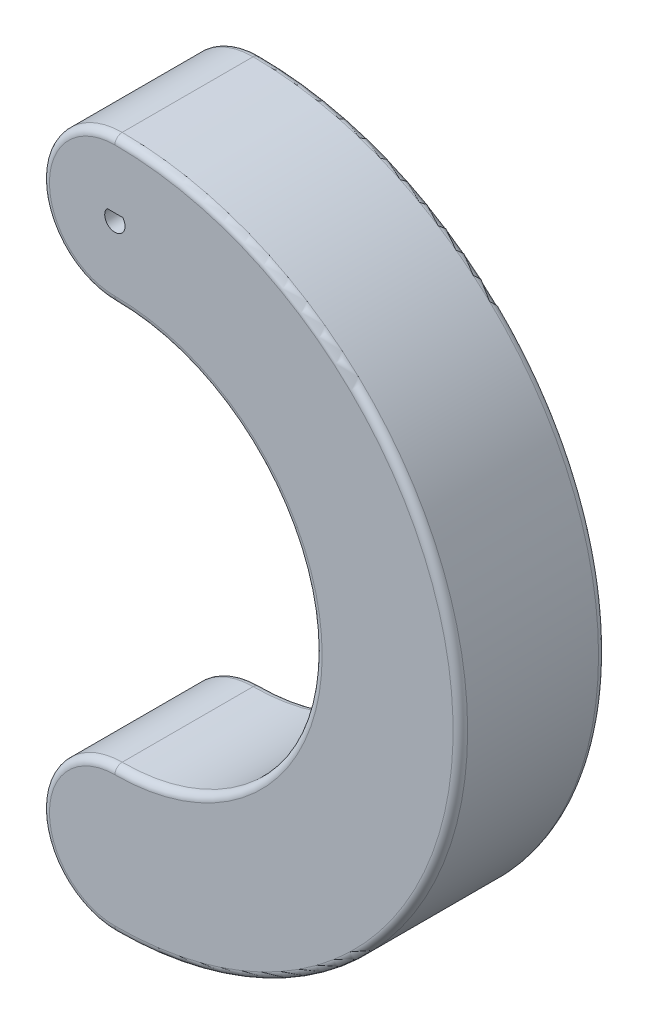
ISO-10303-21;
HEADER;
FILE_DESCRIPTION(('STEP AP214'),'2;1');
FILE_NAME('part.step','',(''),(''),'','','');
FILE_SCHEMA(('AUTOMOTIVE_DESIGN { 1 0 10303 214 1 1 1 1 }'));
ENDSEC;
DATA;
#1=APPLICATION_CONTEXT('core data for automotive mechanical design processes');
#2=APPLICATION_PROTOCOL_DEFINITION('international standard','automotive_design',2000,#1);
#3=PRODUCT_CONTEXT('',#1,'mechanical');
#4=PRODUCT('Part','Part','',(#3));
#5=PRODUCT_RELATED_PRODUCT_CATEGORY('part','',(#4));
#6=PRODUCT_DEFINITION_FORMATION('','',#4);
#7=PRODUCT_DEFINITION_CONTEXT('part definition',#1,'design');
#8=PRODUCT_DEFINITION('design','',#6,#7);
#9=PRODUCT_DEFINITION_SHAPE('','',#8);
#10=(LENGTH_UNIT() NAMED_UNIT(*) SI_UNIT(.MILLI.,.METRE.));
#11=(NAMED_UNIT(*) PLANE_ANGLE_UNIT() SI_UNIT($,.RADIAN.));
#12=(NAMED_UNIT(*) SI_UNIT($,.STERADIAN.) SOLID_ANGLE_UNIT());
#13=UNCERTAINTY_MEASURE_WITH_UNIT(LENGTH_MEASURE(1.E-05),#10,'distance_accuracy_value','');
#14=(GEOMETRIC_REPRESENTATION_CONTEXT(3) GLOBAL_UNCERTAINTY_ASSIGNED_CONTEXT((#13)) GLOBAL_UNIT_ASSIGNED_CONTEXT((#10,
#11,#12)) REPRESENTATION_CONTEXT('',''));
#15=CARTESIAN_POINT('',(0.,0.,0.));
#16=DIRECTION('',(0.,0.,1.));
#17=DIRECTION('',(1.,0.,0.));
#18=AXIS2_PLACEMENT_3D('',#15,#16,#17);
#19=CARTESIAN_POINT('',(0.,0.635,20.));
#20=DIRECTION('',(0.,0.,-1.));
#21=DIRECTION('',(-1.,0.,0.));
#22=AXIS2_PLACEMENT_3D('',#19,#20,#21);
#23=CYLINDRICAL_SURFACE('',#22,10.);
#24=DIRECTION('',(0.,0.,-1.));
#25=VECTOR('',#24,1.);
#26=CARTESIAN_POINT('',(0.,10.635,20.));
#27=LINE('',#26,#25);
#28=CARTESIAN_POINT('',(0.,10.635,19.));
#29=VERTEX_POINT('',#28);
#30=CARTESIAN_POINT('',(0.,10.635,1.));
#31=VERTEX_POINT('',#30);
#32=EDGE_CURVE('E147',#29,#31,#27,.T.);
#33=ORIENTED_EDGE('',*,*,#32,.T.);
#34=CARTESIAN_POINT('',(0.,0.635,1.));
#35=DIRECTION('',(0.,0.,1.));
#36=DIRECTION('',(1.,0.,0.));
#37=AXIS2_PLACEMENT_3D('',#34,#35,#36);
#38=CIRCLE('',#37,10.);
#39=CARTESIAN_POINT('',(0.,-9.365,1.));
#40=VERTEX_POINT('',#39);
#41=EDGE_CURVE('E187',#31,#40,#38,.T.);
#42=ORIENTED_EDGE('',*,*,#41,.T.);
#43=DIRECTION('',(0.,0.,-1.));
#44=VECTOR('',#43,1.);
#45=CARTESIAN_POINT('',(0.,-9.365,20.));
#46=LINE('',#45,#44);
#47=CARTESIAN_POINT('',(0.,-9.365,19.));
#48=VERTEX_POINT('',#47);
#49=EDGE_CURVE('E177',#48,#40,#46,.T.);
#50=ORIENTED_EDGE('',*,*,#49,.F.);
#51=CARTESIAN_POINT('',(0.,0.635,19.));
#52=DIRECTION('',(0.,0.,1.));
#53=DIRECTION('',(1.,0.,0.));
#54=AXIS2_PLACEMENT_3D('',#51,#52,#53);
#55=CIRCLE('',#54,10.);
#56=EDGE_CURVE('E181',#48,#29,#55,.F.);
#57=ORIENTED_EDGE('',*,*,#56,.T.);
#58=EDGE_LOOP('',(#33,#42,#50,#57));
#59=FACE_BOUND('',#58,.T.);
#60=ADVANCED_FACE('F49',(#59),#23,.T.);
#61=CARTESIAN_POINT('',(0.,-36.865,20.));
#62=DIRECTION('',(0.,0.,-1.));
#63=DIRECTION('',(-1.,0.,0.));
#64=AXIS2_PLACEMENT_3D('',#61,#62,#63);
#65=CYLINDRICAL_SURFACE('',#64,27.5);
#66=ORIENTED_EDGE('',*,*,#49,.T.);
#67=CARTESIAN_POINT('',(0.,-36.865,1.));
#68=DIRECTION('',(0.,0.,1.));
#69=DIRECTION('',(1.,0.,0.));
#70=AXIS2_PLACEMENT_3D('',#67,#68,#69);
#71=CIRCLE('',#70,27.5);
#72=CARTESIAN_POINT('',(0.,-64.365,1.));
#73=VERTEX_POINT('',#72);
#74=EDGE_CURVE('E207',#40,#73,#71,.F.);
#75=ORIENTED_EDGE('',*,*,#74,.T.);
#76=DIRECTION('',(0.,0.,-1.));
#77=VECTOR('',#76,1.);
#78=CARTESIAN_POINT('',(0.,-64.365,20.));
#79=LINE('',#78,#77);
#80=CARTESIAN_POINT('',(0.,-64.365,19.));
#81=VERTEX_POINT('',#80);
#82=EDGE_CURVE('E173',#81,#73,#79,.T.);
#83=ORIENTED_EDGE('',*,*,#82,.F.);
#84=CARTESIAN_POINT('',(0.,-36.865,19.));
#85=DIRECTION('',(0.,0.,1.));
#86=DIRECTION('',(1.,0.,0.));
#87=AXIS2_PLACEMENT_3D('',#84,#85,#86);
#88=CIRCLE('',#87,27.5);
#89=EDGE_CURVE('E204',#81,#48,#88,.T.);
#90=ORIENTED_EDGE('',*,*,#89,.T.);
#91=EDGE_LOOP('',(#66,#75,#83,#90));
#92=FACE_BOUND('',#91,.T.);
#93=ADVANCED_FACE('F268',(#92),#65,.F.);
#94=CARTESIAN_POINT('',(0.,-74.365,20.));
#95=DIRECTION('',(0.,0.,-1.));
#96=DIRECTION('',(-1.,0.,0.));
#97=AXIS2_PLACEMENT_3D('',#94,#95,#96);
#98=CYLINDRICAL_SURFACE('',#97,10.);
#99=ORIENTED_EDGE('',*,*,#82,.T.);
#100=CARTESIAN_POINT('',(0.,-74.365,1.));
#101=DIRECTION('',(0.,0.,1.));
#102=DIRECTION('',(1.,0.,0.));
#103=AXIS2_PLACEMENT_3D('',#100,#101,#102);
#104=CIRCLE('',#103,10.);
#105=CARTESIAN_POINT('',(0.,-84.365,1.));
#106=VERTEX_POINT('',#105);
#107=EDGE_CURVE('E213',#73,#106,#104,.T.);
#108=ORIENTED_EDGE('',*,*,#107,.T.);
#109=DIRECTION('',(0.,0.,-1.));
#110=VECTOR('',#109,1.);
#111=CARTESIAN_POINT('',(0.,-84.365,20.));
#112=LINE('',#111,#110);
#113=CARTESIAN_POINT('',(0.,-84.365,19.));
#114=VERTEX_POINT('',#113);
#115=EDGE_CURVE('E169',#114,#106,#112,.T.);
#116=ORIENTED_EDGE('',*,*,#115,.F.);
#117=CARTESIAN_POINT('',(0.,-74.365,19.));
#118=DIRECTION('',(0.,0.,1.));
#119=DIRECTION('',(1.,0.,0.));
#120=AXIS2_PLACEMENT_3D('',#117,#118,#119);
#121=CIRCLE('',#120,10.);
#122=EDGE_CURVE('E210',#114,#81,#121,.F.);
#123=ORIENTED_EDGE('',*,*,#122,.T.);
#124=EDGE_LOOP('',(#99,#108,#116,#123));
#125=FACE_BOUND('',#124,.T.);
#126=ADVANCED_FACE('F265',(#125),#98,.T.);
#127=CARTESIAN_POINT('',(0.,0.635,20.));
#128=DIRECTION('',(0.,0.,-1.));
#129=DIRECTION('',(-1.,0.,0.));
#130=AXIS2_PLACEMENT_3D('',#127,#128,#129);
#131=CYLINDRICAL_SURFACE('',#130,1.4);
#132=CARTESIAN_POINT('',(0.,0.635,0.));
#133=DIRECTION('',(0.,0.,1.));
#134=DIRECTION('',(1.,0.,0.));
#135=AXIS2_PLACEMENT_3D('',#132,#133,#134);
#136=CIRCLE('',#135,1.4);
#137=CARTESIAN_POINT('',(-1.07238052949222,1.53499999998111,0.));
#138=VERTEX_POINT('',#137);
#139=CARTESIAN_POINT('',(1.0723805294251,1.53500000006108,0.));
#140=VERTEX_POINT('',#139);
#141=EDGE_CURVE('E142',#138,#140,#136,.T.);
#142=ORIENTED_EDGE('',*,*,#141,.F.);
#143=DIRECTION('',(0.,0.,-1.));
#144=VECTOR('',#143,1.);
#145=CARTESIAN_POINT('',(-1.07238052949222,1.53499999998111,20.));
#146=LINE('',#145,#144);
#147=CARTESIAN_POINT('',(-1.07238052949222,1.53499999998111,20.));
#148=VERTEX_POINT('',#147);
#149=EDGE_CURVE('E136',#148,#138,#146,.T.);
#150=ORIENTED_EDGE('',*,*,#149,.F.);
#151=CARTESIAN_POINT('',(0.,0.635,20.));
#152=DIRECTION('',(0.,0.,1.));
#153=DIRECTION('',(1.,0.,0.));
#154=AXIS2_PLACEMENT_3D('',#151,#152,#153);
#155=CIRCLE('',#154,1.4);
#156=CARTESIAN_POINT('',(1.0723805294251,1.53500000006108,20.));
#157=VERTEX_POINT('',#156);
#158=EDGE_CURVE('E140',#148,#157,#155,.T.);
#159=ORIENTED_EDGE('',*,*,#158,.T.);
#160=DIRECTION('',(0.,0.,-1.));
#161=VECTOR('',#160,1.);
#162=CARTESIAN_POINT('',(1.0723805294251,1.53500000006108,20.));
#163=LINE('',#162,#161);
#164=EDGE_CURVE('E148',#157,#140,#163,.T.);
#165=ORIENTED_EDGE('',*,*,#164,.T.);
#166=EDGE_LOOP('',(#142,#150,#159,#165));
#167=FACE_BOUND('',#166,.T.);
#168=ADVANCED_FACE('F138',(#167),#131,.F.);
#169=CARTESIAN_POINT('',(-5.72382769096972E-11,1.53500000002109,20.));
#170=DIRECTION('',(-3.72887797452187E-11,1.,0.));
#171=DIRECTION('',(-1.,-3.72887797452187E-11,0.));
#172=AXIS2_PLACEMENT_3D('',#169,#170,#171);
#173=PLANE('',#172);
#174=DIRECTION('',(1.,3.72887797452187E-11,0.));
#175=VECTOR('',#174,1.);
#176=CARTESIAN_POINT('',(-5.72382769096972E-11,1.53500000002109,0.));
#177=LINE('',#176,#175);
#178=EDGE_CURVE('E158',#138,#140,#177,.T.);
#179=ORIENTED_EDGE('',*,*,#178,.T.);
#180=ORIENTED_EDGE('',*,*,#164,.F.);
#181=DIRECTION('',(1.,3.72887797452187E-11,0.));
#182=VECTOR('',#181,1.);
#183=CARTESIAN_POINT('',(-5.72382769096972E-11,1.53500000002109,20.));
#184=LINE('',#183,#182);
#185=EDGE_CURVE('E151',#148,#157,#184,.T.);
#186=ORIENTED_EDGE('',*,*,#185,.F.);
#187=ORIENTED_EDGE('',*,*,#149,.T.);
#188=EDGE_LOOP('',(#179,#180,#186,#187));
#189=FACE_BOUND('',#188,.T.);
#190=ADVANCED_FACE('F152',(#189),#173,.F.);
#191=CARTESIAN_POINT('',(0.,-36.865,20.));
#192=DIRECTION('',(0.,0.,-1.));
#193=DIRECTION('',(-1.,0.,0.));
#194=AXIS2_PLACEMENT_3D('',#191,#192,#193);
#195=CYLINDRICAL_SURFACE('',#194,47.5);
#196=ORIENTED_EDGE('',*,*,#115,.T.);
#197=CARTESIAN_POINT('',(0.,-36.865,1.));
#198=DIRECTION('',(0.,0.,1.));
#199=DIRECTION('',(1.,0.,0.));
#200=AXIS2_PLACEMENT_3D('',#197,#198,#199);
#201=CIRCLE('',#200,47.5);
#202=EDGE_CURVE('E11',#106,#31,#201,.T.);
#203=ORIENTED_EDGE('',*,*,#202,.T.);
#204=ORIENTED_EDGE('',*,*,#32,.F.);
#205=CARTESIAN_POINT('',(0.,-36.865,19.));
#206=DIRECTION('',(0.,0.,1.));
#207=DIRECTION('',(1.,0.,0.));
#208=AXIS2_PLACEMENT_3D('',#205,#206,#207);
#209=CIRCLE('',#208,47.5);
#210=EDGE_CURVE('E59',#29,#114,#209,.F.);
#211=ORIENTED_EDGE('',*,*,#210,.T.);
#212=EDGE_LOOP('',(#196,#203,#204,#211));
#213=FACE_BOUND('',#212,.T.);
#214=ADVANCED_FACE('F293',(#213),#195,.T.);
#215=CARTESIAN_POINT('',(0.,0.,20.));
#216=DIRECTION('',(0.,0.,1.));
#217=DIRECTION('',(1.,0.,0.));
#218=AXIS2_PLACEMENT_3D('',#215,#216,#217);
#219=PLANE('',#218);
#220=CARTESIAN_POINT('',(0.,-36.865,20.));
#221=DIRECTION('',(0.,0.,1.));
#222=DIRECTION('',(1.,0.,0.));
#223=AXIS2_PLACEMENT_3D('',#220,#221,#222);
#224=CIRCLE('',#223,46.5);
#225=CARTESIAN_POINT('',(0.,-83.365,20.));
#226=VERTEX_POINT('',#225);
#227=CARTESIAN_POINT('',(0.,9.635,20.));
#228=VERTEX_POINT('',#227);
#229=EDGE_CURVE('E216',#226,#228,#224,.T.);
#230=ORIENTED_EDGE('',*,*,#229,.T.);
#231=CARTESIAN_POINT('',(0.,0.635,20.));
#232=DIRECTION('',(0.,0.,1.));
#233=DIRECTION('',(1.,0.,0.));
#234=AXIS2_PLACEMENT_3D('',#231,#232,#233);
#235=CIRCLE('',#234,9.);
#236=CARTESIAN_POINT('',(0.,-8.365,20.));
#237=VERTEX_POINT('',#236);
#238=EDGE_CURVE('E224',#228,#237,#235,.T.);
#239=ORIENTED_EDGE('',*,*,#238,.T.);
#240=CARTESIAN_POINT('',(0.,-36.865,20.));
#241=DIRECTION('',(0.,0.,1.));
#242=DIRECTION('',(1.,0.,0.));
#243=AXIS2_PLACEMENT_3D('',#240,#241,#242);
#244=CIRCLE('',#243,28.5);
#245=CARTESIAN_POINT('',(0.,-65.365,20.));
#246=VERTEX_POINT('',#245);
#247=EDGE_CURVE('E74',#237,#246,#244,.F.);
#248=ORIENTED_EDGE('',*,*,#247,.T.);
#249=CARTESIAN_POINT('',(0.,-74.365,20.));
#250=DIRECTION('',(0.,0.,1.));
#251=DIRECTION('',(1.,0.,0.));
#252=AXIS2_PLACEMENT_3D('',#249,#250,#251);
#253=CIRCLE('',#252,9.);
#254=EDGE_CURVE('E219',#246,#226,#253,.T.);
#255=ORIENTED_EDGE('',*,*,#254,.T.);
#256=EDGE_LOOP('',(#230,#239,#248,#255));
#257=FACE_BOUND('',#256,.T.);
#258=ORIENTED_EDGE('',*,*,#158,.F.);
#259=ORIENTED_EDGE('',*,*,#185,.T.);
#260=EDGE_LOOP('',(#258,#259));
#261=FACE_BOUND('',#260,.T.);
#262=ADVANCED_FACE('F156',(#257,#261),#219,.T.);
#263=CARTESIAN_POINT('',(0.,0.,0.));
#264=DIRECTION('',(0.,0.,1.));
#265=DIRECTION('',(1.,0.,0.));
#266=AXIS2_PLACEMENT_3D('',#263,#264,#265);
#267=PLANE('',#266);
#268=CARTESIAN_POINT('',(0.,-36.865,0.));
#269=DIRECTION('',(0.,0.,1.));
#270=DIRECTION('',(1.,0.,0.));
#271=AXIS2_PLACEMENT_3D('',#268,#269,#270);
#272=CIRCLE('',#271,28.5);
#273=CARTESIAN_POINT('',(0.,-65.365,0.));
#274=VERTEX_POINT('',#273);
#275=CARTESIAN_POINT('',(0.,-8.365,0.));
#276=VERTEX_POINT('',#275);
#277=EDGE_CURVE('E197',#274,#276,#272,.T.);
#278=ORIENTED_EDGE('',*,*,#277,.T.);
#279=CARTESIAN_POINT('',(0.,0.635,0.));
#280=DIRECTION('',(0.,0.,1.));
#281=DIRECTION('',(1.,0.,0.));
#282=AXIS2_PLACEMENT_3D('',#279,#280,#281);
#283=CIRCLE('',#282,9.);
#284=CARTESIAN_POINT('',(0.,9.635,0.));
#285=VERTEX_POINT('',#284);
#286=EDGE_CURVE('E200',#276,#285,#283,.F.);
#287=ORIENTED_EDGE('',*,*,#286,.T.);
#288=CARTESIAN_POINT('',(0.,-36.865,0.));
#289=DIRECTION('',(0.,0.,1.));
#290=DIRECTION('',(1.,0.,0.));
#291=AXIS2_PLACEMENT_3D('',#288,#289,#290);
#292=CIRCLE('',#291,46.5);
#293=CARTESIAN_POINT('',(0.,-83.365,0.));
#294=VERTEX_POINT('',#293);
#295=EDGE_CURVE('E191',#285,#294,#292,.F.);
#296=ORIENTED_EDGE('',*,*,#295,.T.);
#297=CARTESIAN_POINT('',(0.,-74.365,0.));
#298=DIRECTION('',(0.,0.,1.));
#299=DIRECTION('',(1.,0.,0.));
#300=AXIS2_PLACEMENT_3D('',#297,#298,#299);
#301=CIRCLE('',#300,9.);
#302=EDGE_CURVE('E194',#294,#274,#301,.F.);
#303=ORIENTED_EDGE('',*,*,#302,.T.);
#304=EDGE_LOOP('',(#278,#287,#296,#303));
#305=FACE_BOUND('',#304,.T.);
#306=ORIENTED_EDGE('',*,*,#141,.T.);
#307=ORIENTED_EDGE('',*,*,#178,.F.);
#308=EDGE_LOOP('',(#306,#307));
#309=FACE_BOUND('',#308,.T.);
#310=ADVANCED_FACE('F285',(#305,#309),#267,.F.);
#311=CARTESIAN_POINT('',(0.,-74.365,1.));
#312=DIRECTION('',(0.,0.,1.));
#313=DIRECTION('',(1.,0.,0.));
#314=AXIS2_PLACEMENT_3D('',#311,#312,#313);
#315=TOROIDAL_SURFACE('',#314,9.,1.);
#316=CARTESIAN_POINT('',(0.,-65.365,1.));
#317=DIRECTION('',(1.,0.,0.));
#318=DIRECTION('',(0.,1.,0.));
#319=AXIS2_PLACEMENT_3D('',#316,#317,#318);
#320=CIRCLE('',#319,1.);
#321=EDGE_CURVE('E235',#274,#73,#320,.T.);
#322=ORIENTED_EDGE('',*,*,#321,.F.);
#323=ORIENTED_EDGE('',*,*,#302,.F.);
#324=CARTESIAN_POINT('',(0.,-83.365,1.));
#325=DIRECTION('',(1.,0.,0.));
#326=DIRECTION('',(0.,1.,0.));
#327=AXIS2_PLACEMENT_3D('',#324,#325,#326);
#328=CIRCLE('',#327,1.);
#329=EDGE_CURVE('E164',#106,#294,#328,.T.);
#330=ORIENTED_EDGE('',*,*,#329,.F.);
#331=ORIENTED_EDGE('',*,*,#107,.F.);
#332=EDGE_LOOP('',(#322,#323,#330,#331));
#333=FACE_BOUND('',#332,.T.);
#334=ADVANCED_FACE('F290',(#333),#315,.T.);
#335=CARTESIAN_POINT('',(0.,-36.865,1.));
#336=DIRECTION('',(0.,0.,1.));
#337=DIRECTION('',(1.,0.,0.));
#338=AXIS2_PLACEMENT_3D('',#335,#336,#337);
#339=TOROIDAL_SURFACE('',#338,46.5,1.);
#340=ORIENTED_EDGE('',*,*,#329,.T.);
#341=ORIENTED_EDGE('',*,*,#295,.F.);
#342=CARTESIAN_POINT('',(0.,9.635,1.));
#343=DIRECTION('',(-1.,0.,0.));
#344=DIRECTION('',(0.,-1.,0.));
#345=AXIS2_PLACEMENT_3D('',#342,#343,#344);
#346=CIRCLE('',#345,1.);
#347=EDGE_CURVE('E232',#31,#285,#346,.T.);
#348=ORIENTED_EDGE('',*,*,#347,.F.);
#349=ORIENTED_EDGE('',*,*,#202,.F.);
#350=EDGE_LOOP('',(#340,#341,#348,#349));
#351=FACE_BOUND('',#350,.T.);
#352=ADVANCED_FACE('F295',(#351),#339,.T.);
#353=CARTESIAN_POINT('',(0.,-36.865,1.));
#354=DIRECTION('',(0.,0.,1.));
#355=DIRECTION('',(1.,0.,0.));
#356=AXIS2_PLACEMENT_3D('',#353,#354,#355);
#357=TOROIDAL_SURFACE('',#356,28.5,1.);
#358=ORIENTED_EDGE('',*,*,#321,.T.);
#359=ORIENTED_EDGE('',*,*,#74,.F.);
#360=CARTESIAN_POINT('',(0.,-8.365,1.));
#361=DIRECTION('',(-1.,0.,0.));
#362=DIRECTION('',(0.,-1.,0.));
#363=AXIS2_PLACEMENT_3D('',#360,#361,#362);
#364=CIRCLE('',#363,1.);
#365=EDGE_CURVE('E229',#276,#40,#364,.T.);
#366=ORIENTED_EDGE('',*,*,#365,.F.);
#367=ORIENTED_EDGE('',*,*,#277,.F.);
#368=EDGE_LOOP('',(#358,#359,#366,#367));
#369=FACE_BOUND('',#368,.T.);
#370=ADVANCED_FACE('F273',(#369),#357,.T.);
#371=CARTESIAN_POINT('',(0.,0.635,1.));
#372=DIRECTION('',(0.,0.,1.));
#373=DIRECTION('',(1.,0.,0.));
#374=AXIS2_PLACEMENT_3D('',#371,#372,#373);
#375=TOROIDAL_SURFACE('',#374,9.,1.);
#376=ORIENTED_EDGE('',*,*,#347,.T.);
#377=ORIENTED_EDGE('',*,*,#286,.F.);
#378=ORIENTED_EDGE('',*,*,#365,.T.);
#379=ORIENTED_EDGE('',*,*,#41,.F.);
#380=EDGE_LOOP('',(#376,#377,#378,#379));
#381=FACE_BOUND('',#380,.T.);
#382=ADVANCED_FACE('F281',(#381),#375,.T.);
#383=CARTESIAN_POINT('',(0.,-74.365,19.));
#384=DIRECTION('',(0.,0.,1.));
#385=DIRECTION('',(1.,0.,0.));
#386=AXIS2_PLACEMENT_3D('',#383,#384,#385);
#387=TOROIDAL_SURFACE('',#386,9.,1.);
#388=CARTESIAN_POINT('',(0.,-65.365,19.));
#389=DIRECTION('',(1.,0.,0.));
#390=DIRECTION('',(0.,0.,-1.));
#391=AXIS2_PLACEMENT_3D('',#388,#389,#390);
#392=CIRCLE('',#391,1.);
#393=EDGE_CURVE('E246',#81,#246,#392,.T.);
#394=ORIENTED_EDGE('',*,*,#393,.F.);
#395=ORIENTED_EDGE('',*,*,#122,.F.);
#396=CARTESIAN_POINT('',(0.,-83.365,19.));
#397=DIRECTION('',(1.,0.,0.));
#398=DIRECTION('',(0.,1.,0.));
#399=AXIS2_PLACEMENT_3D('',#396,#397,#398);
#400=CIRCLE('',#399,1.);
#401=EDGE_CURVE('E53',#226,#114,#400,.T.);
#402=ORIENTED_EDGE('',*,*,#401,.F.);
#403=ORIENTED_EDGE('',*,*,#254,.F.);
#404=EDGE_LOOP('',(#394,#395,#402,#403));
#405=FACE_BOUND('',#404,.T.);
#406=ADVANCED_FACE('F51',(#405),#387,.T.);
#407=CARTESIAN_POINT('',(0.,-36.865,19.));
#408=DIRECTION('',(0.,0.,1.));
#409=DIRECTION('',(1.,0.,0.));
#410=AXIS2_PLACEMENT_3D('',#407,#408,#409);
#411=TOROIDAL_SURFACE('',#410,46.5,1.);
#412=ORIENTED_EDGE('',*,*,#401,.T.);
#413=ORIENTED_EDGE('',*,*,#210,.F.);
#414=CARTESIAN_POINT('',(0.,9.635,19.));
#415=DIRECTION('',(-1.,0.,0.));
#416=DIRECTION('',(0.,-1.,0.));
#417=AXIS2_PLACEMENT_3D('',#414,#415,#416);
#418=CIRCLE('',#417,1.);
#419=EDGE_CURVE('E244',#228,#29,#418,.T.);
#420=ORIENTED_EDGE('',*,*,#419,.F.);
#421=ORIENTED_EDGE('',*,*,#229,.F.);
#422=EDGE_LOOP('',(#412,#413,#420,#421));
#423=FACE_BOUND('',#422,.T.);
#424=ADVANCED_FACE('F258',(#423),#411,.T.);
#425=CARTESIAN_POINT('',(0.,-36.865,19.));
#426=DIRECTION('',(0.,0.,1.));
#427=DIRECTION('',(1.,0.,0.));
#428=AXIS2_PLACEMENT_3D('',#425,#426,#427);
#429=TOROIDAL_SURFACE('',#428,28.5,1.);
#430=ORIENTED_EDGE('',*,*,#393,.T.);
#431=ORIENTED_EDGE('',*,*,#247,.F.);
#432=CARTESIAN_POINT('',(0.,-8.365,19.));
#433=DIRECTION('',(-1.,0.,0.));
#434=DIRECTION('',(0.,-1.,0.));
#435=AXIS2_PLACEMENT_3D('',#432,#433,#434);
#436=CIRCLE('',#435,1.);
#437=EDGE_CURVE('E67',#48,#237,#436,.T.);
#438=ORIENTED_EDGE('',*,*,#437,.F.);
#439=ORIENTED_EDGE('',*,*,#89,.F.);
#440=EDGE_LOOP('',(#430,#431,#438,#439));
#441=FACE_BOUND('',#440,.T.);
#442=ADVANCED_FACE('F323',(#441),#429,.T.);
#443=CARTESIAN_POINT('',(0.,0.635,19.));
#444=DIRECTION('',(0.,0.,1.));
#445=DIRECTION('',(1.,0.,0.));
#446=AXIS2_PLACEMENT_3D('',#443,#444,#445);
#447=TOROIDAL_SURFACE('',#446,9.,1.);
#448=ORIENTED_EDGE('',*,*,#419,.T.);
#449=ORIENTED_EDGE('',*,*,#56,.F.);
#450=ORIENTED_EDGE('',*,*,#437,.T.);
#451=ORIENTED_EDGE('',*,*,#238,.F.);
#452=EDGE_LOOP('',(#448,#449,#450,#451));
#453=FACE_BOUND('',#452,.T.);
#454=ADVANCED_FACE('F327',(#453),#447,.T.);
#455=CLOSED_SHELL('',(#60,#93,#126,#168,#190,#214,#262,#310,#334,#352,#370,#382,#406,#424,#442,#454));
#456=MANIFOLD_SOLID_BREP('B2',#455);
#457=ADVANCED_BREP_SHAPE_REPRESENTATION('',(#18,#456),#14);
#458=SHAPE_DEFINITION_REPRESENTATION(#9,#457);
ENDSEC;
END-ISO-10303-21;
